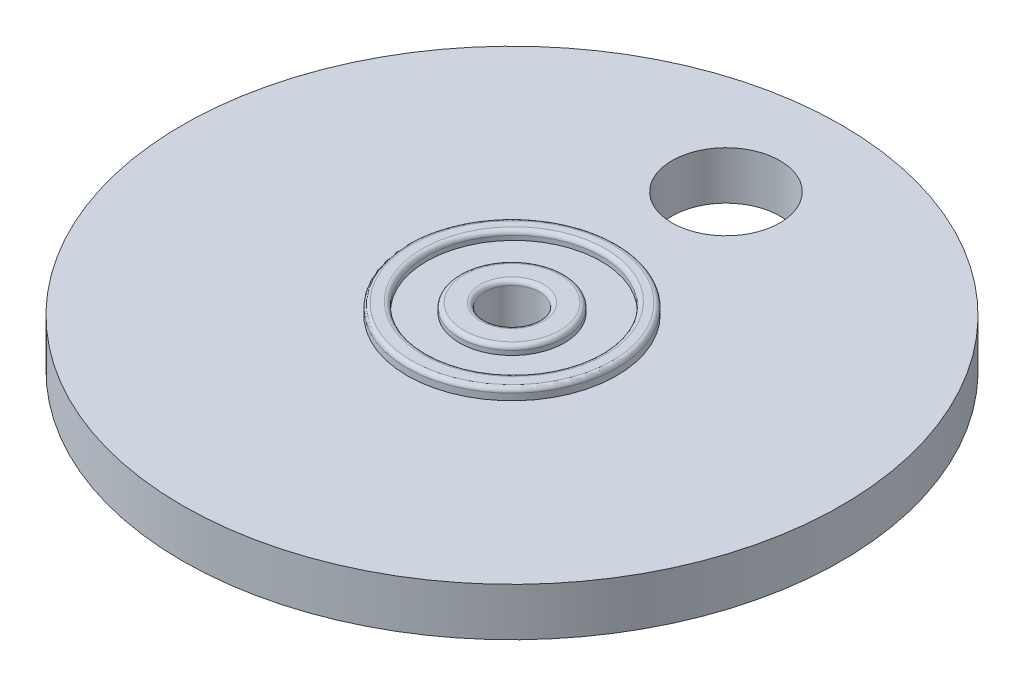
ISO-10303-21;
HEADER;
FILE_DESCRIPTION(('STEP AP214'),'2;1');
FILE_NAME('part.step','',(''),(''),'','','');
FILE_SCHEMA(('AUTOMOTIVE_DESIGN { 1 0 10303 214 1 1 1 1 }'));
ENDSEC;
DATA;
#1=APPLICATION_CONTEXT('core data for automotive mechanical design processes');
#2=APPLICATION_PROTOCOL_DEFINITION('international standard','automotive_design',2000,#1);
#3=PRODUCT_CONTEXT('',#1,'mechanical');
#4=PRODUCT('Part','Part','',(#3));
#5=PRODUCT_RELATED_PRODUCT_CATEGORY('part','',(#4));
#6=PRODUCT_DEFINITION_FORMATION('','',#4);
#7=PRODUCT_DEFINITION_CONTEXT('part definition',#1,'design');
#8=PRODUCT_DEFINITION('design','',#6,#7);
#9=PRODUCT_DEFINITION_SHAPE('','',#8);
#10=(LENGTH_UNIT() NAMED_UNIT(*) SI_UNIT(.MILLI.,.METRE.));
#11=(NAMED_UNIT(*) PLANE_ANGLE_UNIT() SI_UNIT($,.RADIAN.));
#12=(NAMED_UNIT(*) SI_UNIT($,.STERADIAN.) SOLID_ANGLE_UNIT());
#13=UNCERTAINTY_MEASURE_WITH_UNIT(LENGTH_MEASURE(1.E-05),#10,'distance_accuracy_value','');
#14=(GEOMETRIC_REPRESENTATION_CONTEXT(3) GLOBAL_UNCERTAINTY_ASSIGNED_CONTEXT((#13)) GLOBAL_UNIT_ASSIGNED_CONTEXT((#10,
#11,#12)) REPRESENTATION_CONTEXT('',''));
#15=CARTESIAN_POINT('',(0.,0.,0.));
#16=DIRECTION('',(0.,0.,1.));
#17=DIRECTION('',(1.,0.,0.));
#18=AXIS2_PLACEMENT_3D('',#15,#16,#17);
#19=CARTESIAN_POINT('',(0.,8.,0.));
#20=DIRECTION('',(0.,-1.,0.));
#21=DIRECTION('',(0.,0.,-1.));
#22=AXIS2_PLACEMENT_3D('',#19,#20,#21);
#23=CYLINDRICAL_SURFACE('',#22,12.);
#24=CARTESIAN_POINT('',(0.,0.5,0.));
#25=DIRECTION('',(0.,1.,0.));
#26=DIRECTION('',(0.,0.,1.));
#27=AXIS2_PLACEMENT_3D('',#24,#25,#26);
#28=CIRCLE('',#27,12.);
#29=CARTESIAN_POINT('',(0.,0.5,12.));
#30=VERTEX_POINT('',#29);
#31=EDGE_CURVE('E110',#30,#30,#28,.T.);
#32=ORIENTED_EDGE('',*,*,#31,.T.);
#33=EDGE_LOOP('',(#32));
#34=FACE_BOUND('',#33,.T.);
#35=CARTESIAN_POINT('',(0.,1.25,0.));
#36=DIRECTION('',(0.,1.,0.));
#37=DIRECTION('',(0.,0.,1.));
#38=AXIS2_PLACEMENT_3D('',#35,#36,#37);
#39=CIRCLE('',#38,12.);
#40=CARTESIAN_POINT('',(0.,1.25,12.));
#41=VERTEX_POINT('',#40);
#42=EDGE_CURVE('E10',#41,#41,#39,.T.);
#43=ORIENTED_EDGE('',*,*,#42,.F.);
#44=EDGE_LOOP('',(#43));
#45=FACE_BOUND('',#44,.T.);
#46=ADVANCED_FACE('F42',(#34,#45),#23,.T.);
#47=CARTESIAN_POINT('',(0.,0.,0.));
#48=DIRECTION('',(0.,1.,0.));
#49=DIRECTION('',(0.,0.,1.));
#50=AXIS2_PLACEMENT_3D('',#47,#48,#49);
#51=PLANE('',#50);
#52=CARTESIAN_POINT('',(0.,0.,0.));
#53=DIRECTION('',(0.,1.,0.));
#54=DIRECTION('',(0.,0.,1.));
#55=AXIS2_PLACEMENT_3D('',#52,#53,#54);
#56=CIRCLE('',#55,5.5);
#57=CARTESIAN_POINT('',(0.,0.,5.5));
#58=VERTEX_POINT('',#57);
#59=EDGE_CURVE('E90',#58,#58,#56,.F.);
#60=ORIENTED_EDGE('',*,*,#59,.T.);
#61=EDGE_LOOP('',(#60));
#62=FACE_BOUND('',#61,.T.);
#63=CARTESIAN_POINT('',(0.,0.,0.));
#64=DIRECTION('',(0.,1.,0.));
#65=DIRECTION('',(0.,0.,1.));
#66=AXIS2_PLACEMENT_3D('',#63,#64,#65);
#67=CIRCLE('',#66,3.625);
#68=CARTESIAN_POINT('',(0.,0.,3.625));
#69=VERTEX_POINT('',#68);
#70=EDGE_CURVE('E94',#69,#69,#67,.T.);
#71=ORIENTED_EDGE('',*,*,#70,.T.);
#72=EDGE_LOOP('',(#71));
#73=FACE_BOUND('',#72,.T.);
#74=ADVANCED_FACE('F170',(#62,#73),#51,.F.);
#75=CARTESIAN_POINT('',(0.,8.,0.));
#76=DIRECTION('',(0.,1.,0.));
#77=DIRECTION('',(0.,0.,1.));
#78=AXIS2_PLACEMENT_3D('',#75,#76,#77);
#79=PLANE('',#78);
#80=CARTESIAN_POINT('',(0.,8.,0.));
#81=DIRECTION('',(0.,1.,0.));
#82=DIRECTION('',(0.,0.,1.));
#83=AXIS2_PLACEMENT_3D('',#80,#81,#82);
#84=CIRCLE('',#83,3.625);
#85=CARTESIAN_POINT('',(0.,8.,3.625));
#86=VERTEX_POINT('',#85);
#87=EDGE_CURVE('E70',#86,#86,#84,.F.);
#88=ORIENTED_EDGE('',*,*,#87,.T.);
#89=EDGE_LOOP('',(#88));
#90=FACE_BOUND('',#89,.T.);
#91=CARTESIAN_POINT('',(0.,8.,0.));
#92=DIRECTION('',(0.,1.,0.));
#93=DIRECTION('',(0.,0.,1.));
#94=AXIS2_PLACEMENT_3D('',#91,#92,#93);
#95=CIRCLE('',#94,5.5);
#96=CARTESIAN_POINT('',(0.,8.,5.5));
#97=VERTEX_POINT('',#96);
#98=EDGE_CURVE('E74',#97,#97,#95,.T.);
#99=ORIENTED_EDGE('',*,*,#98,.T.);
#100=EDGE_LOOP('',(#99));
#101=FACE_BOUND('',#100,.T.);
#102=ADVANCED_FACE('F179',(#90,#101),#79,.T.);
#103=CARTESIAN_POINT('',(0.,8.,0.));
#104=DIRECTION('',(0.,1.,0.));
#105=DIRECTION('',(0.,0.,1.));
#106=AXIS2_PLACEMENT_3D('',#103,#104,#105);
#107=CIRCLE('',#106,11.5);
#108=CARTESIAN_POINT('',(0.,8.,11.5));
#109=VERTEX_POINT('',#108);
#110=EDGE_CURVE('E56',#109,#109,#107,.T.);
#111=ORIENTED_EDGE('',*,*,#110,.T.);
#112=EDGE_LOOP('',(#111));
#113=FACE_BOUND('',#112,.T.);
#114=CARTESIAN_POINT('',(0.,8.,-0.21755259863575));
#115=DIRECTION('',(0.,1.,0.));
#116=DIRECTION('',(0.,0.,1.));
#117=AXIS2_PLACEMENT_3D('',#114,#115,#116);
#118=CIRCLE('',#117,10.5);
#119=CARTESIAN_POINT('',(0.,8.,10.2824474013643));
#120=VERTEX_POINT('',#119);
#121=EDGE_CURVE('E62',#120,#120,#118,.F.);
#122=ORIENTED_EDGE('',*,*,#121,.T.);
#123=EDGE_LOOP('',(#122));
#124=FACE_BOUND('',#123,.T.);
#125=ADVANCED_FACE('F194',(#113,#124),#79,.T.);
#126=CARTESIAN_POINT('',(0.,0.,0.));
#127=DIRECTION('',(0.,1.,0.));
#128=DIRECTION('',(0.,0.,1.));
#129=AXIS2_PLACEMENT_3D('',#126,#127,#128);
#130=CIRCLE('',#129,11.5);
#131=CARTESIAN_POINT('',(0.,0.,11.5));
#132=VERTEX_POINT('',#131);
#133=EDGE_CURVE('E102',#132,#132,#130,.F.);
#134=ORIENTED_EDGE('',*,*,#133,.T.);
#135=EDGE_LOOP('',(#134));
#136=FACE_BOUND('',#135,.T.);
#137=CARTESIAN_POINT('',(0.,0.,-0.21755259863575));
#138=DIRECTION('',(0.,1.,0.));
#139=DIRECTION('',(0.,0.,1.));
#140=AXIS2_PLACEMENT_3D('',#137,#138,#139);
#141=CIRCLE('',#140,10.5);
#142=CARTESIAN_POINT('',(0.,0.,10.2824474013643));
#143=VERTEX_POINT('',#142);
#144=EDGE_CURVE('E106',#143,#143,#141,.T.);
#145=ORIENTED_EDGE('',*,*,#144,.T.);
#146=EDGE_LOOP('',(#145));
#147=FACE_BOUND('',#146,.T.);
#148=ADVANCED_FACE('F182',(#136,#147),#51,.F.);
#149=CARTESIAN_POINT('',(0.,6.75,0.));
#150=DIRECTION('',(0.,1.,0.));
#151=DIRECTION('',(0.,0.,1.));
#152=AXIS2_PLACEMENT_3D('',#149,#150,#151);
#153=CIRCLE('',#152,12.);
#154=CARTESIAN_POINT('',(0.,6.75,12.));
#155=VERTEX_POINT('',#154);
#156=EDGE_CURVE('E139',#155,#155,#153,.T.);
#157=ORIENTED_EDGE('',*,*,#156,.T.);
#158=EDGE_LOOP('',(#157));
#159=FACE_BOUND('',#158,.T.);
#160=CARTESIAN_POINT('',(0.,7.5,0.));
#161=DIRECTION('',(0.,1.,0.));
#162=DIRECTION('',(0.,0.,1.));
#163=AXIS2_PLACEMENT_3D('',#160,#161,#162);
#164=CIRCLE('',#163,12.);
#165=CARTESIAN_POINT('',(0.,7.5,12.));
#166=VERTEX_POINT('',#165);
#167=EDGE_CURVE('E114',#166,#166,#164,.F.);
#168=ORIENTED_EDGE('',*,*,#167,.T.);
#169=EDGE_LOOP('',(#168));
#170=FACE_BOUND('',#169,.T.);
#171=ADVANCED_FACE('F173',(#159,#170),#23,.T.);
#172=CARTESIAN_POINT('',(0.,8.,0.));
#173=DIRECTION('',(0.,-1.,0.));
#174=DIRECTION('',(0.,0.,-1.));
#175=AXIS2_PLACEMENT_3D('',#172,#173,#174);
#176=CYLINDRICAL_SURFACE('',#175,3.125);
#177=CARTESIAN_POINT('',(0.,0.5,0.));
#178=DIRECTION('',(0.,1.,0.));
#179=DIRECTION('',(0.,0.,1.));
#180=AXIS2_PLACEMENT_3D('',#177,#178,#179);
#181=CIRCLE('',#180,3.125);
#182=CARTESIAN_POINT('',(0.,0.5,3.125));
#183=VERTEX_POINT('',#182);
#184=EDGE_CURVE('E78',#183,#183,#181,.F.);
#185=ORIENTED_EDGE('',*,*,#184,.T.);
#186=EDGE_LOOP('',(#185));
#187=FACE_BOUND('',#186,.T.);
#188=CARTESIAN_POINT('',(0.,7.5,0.));
#189=DIRECTION('',(0.,1.,0.));
#190=DIRECTION('',(0.,0.,1.));
#191=AXIS2_PLACEMENT_3D('',#188,#189,#190);
#192=CIRCLE('',#191,3.125);
#193=CARTESIAN_POINT('',(0.,7.5,3.125));
#194=VERTEX_POINT('',#193);
#195=EDGE_CURVE('E82',#194,#194,#192,.T.);
#196=ORIENTED_EDGE('',*,*,#195,.T.);
#197=EDGE_LOOP('',(#196));
#198=FACE_BOUND('',#197,.T.);
#199=ADVANCED_FACE('F185',(#187,#198),#176,.F.);
#200=CARTESIAN_POINT('',(0.,7.,-0.21755259863575));
#201=DIRECTION('',(0.,1.,0.));
#202=DIRECTION('',(0.,0.,1.));
#203=AXIS2_PLACEMENT_3D('',#200,#201,#202);
#204=CYLINDRICAL_SURFACE('',#203,10.);
#205=CARTESIAN_POINT('',(0.,7.5,-0.21755259863575));
#206=DIRECTION('',(0.,1.,0.));
#207=DIRECTION('',(0.,0.,1.));
#208=AXIS2_PLACEMENT_3D('',#205,#206,#207);
#209=CIRCLE('',#208,10.);
#210=CARTESIAN_POINT('',(0.,7.5,9.78244740136425));
#211=VERTEX_POINT('',#210);
#212=EDGE_CURVE('E51',#211,#211,#209,.T.);
#213=ORIENTED_EDGE('',*,*,#212,.T.);
#214=EDGE_LOOP('',(#213));
#215=FACE_BOUND('',#214,.T.);
#216=CARTESIAN_POINT('',(0.,7.,-0.21755259863575));
#217=DIRECTION('',(0.,1.,0.));
#218=DIRECTION('',(0.,0.,1.));
#219=AXIS2_PLACEMENT_3D('',#216,#217,#218);
#220=CIRCLE('',#219,10.);
#221=CARTESIAN_POINT('',(0.,7.,9.78244740136425));
#222=VERTEX_POINT('',#221);
#223=EDGE_CURVE('E118',#222,#222,#220,.T.);
#224=ORIENTED_EDGE('',*,*,#223,.F.);
#225=EDGE_LOOP('',(#224));
#226=FACE_BOUND('',#225,.T.);
#227=ADVANCED_FACE('F190',(#215,#226),#204,.F.);
#228=CARTESIAN_POINT('',(0.,7.,-0.21755259863575));
#229=DIRECTION('',(0.,1.,0.));
#230=DIRECTION('',(0.,0.,1.));
#231=AXIS2_PLACEMENT_3D('',#228,#229,#230);
#232=PLANE('',#231);
#233=CARTESIAN_POINT('',(0.,7.,0.));
#234=DIRECTION('',(0.,1.,0.));
#235=DIRECTION('',(0.,0.,1.));
#236=AXIS2_PLACEMENT_3D('',#233,#234,#235);
#237=CIRCLE('',#236,6.);
#238=CARTESIAN_POINT('',(0.,7.,6.));
#239=VERTEX_POINT('',#238);
#240=EDGE_CURVE('E122',#239,#239,#237,.T.);
#241=ORIENTED_EDGE('',*,*,#240,.F.);
#242=EDGE_LOOP('',(#241));
#243=FACE_BOUND('',#242,.T.);
#244=ORIENTED_EDGE('',*,*,#223,.T.);
#245=EDGE_LOOP('',(#244));
#246=FACE_BOUND('',#245,.T.);
#247=ADVANCED_FACE('F217',(#243,#246),#232,.T.);
#248=CARTESIAN_POINT('',(0.,7.,0.));
#249=DIRECTION('',(0.,1.,0.));
#250=DIRECTION('',(0.,0.,1.));
#251=AXIS2_PLACEMENT_3D('',#248,#249,#250);
#252=CYLINDRICAL_SURFACE('',#251,6.);
#253=CARTESIAN_POINT('',(0.,7.5,0.));
#254=DIRECTION('',(0.,1.,0.));
#255=DIRECTION('',(0.,0.,1.));
#256=AXIS2_PLACEMENT_3D('',#253,#254,#255);
#257=CIRCLE('',#256,6.);
#258=CARTESIAN_POINT('',(0.,7.5,6.));
#259=VERTEX_POINT('',#258);
#260=EDGE_CURVE('E66',#259,#259,#257,.F.);
#261=ORIENTED_EDGE('',*,*,#260,.T.);
#262=EDGE_LOOP('',(#261));
#263=FACE_BOUND('',#262,.T.);
#264=ORIENTED_EDGE('',*,*,#240,.T.);
#265=EDGE_LOOP('',(#264));
#266=FACE_BOUND('',#265,.T.);
#267=ADVANCED_FACE('F222',(#263,#266),#252,.T.);
#268=CARTESIAN_POINT('',(0.,1.,-0.21755259863575));
#269=DIRECTION('',(0.,-1.,0.));
#270=DIRECTION('',(0.,0.,-1.));
#271=AXIS2_PLACEMENT_3D('',#268,#269,#270);
#272=CYLINDRICAL_SURFACE('',#271,10.);
#273=CARTESIAN_POINT('',(0.,0.5,-0.21755259863575));
#274=DIRECTION('',(0.,1.,0.));
#275=DIRECTION('',(0.,0.,1.));
#276=AXIS2_PLACEMENT_3D('',#273,#274,#275);
#277=CIRCLE('',#276,10.);
#278=CARTESIAN_POINT('',(0.,0.5,9.78244740136425));
#279=VERTEX_POINT('',#278);
#280=EDGE_CURVE('E98',#279,#279,#277,.F.);
#281=ORIENTED_EDGE('',*,*,#280,.T.);
#282=EDGE_LOOP('',(#281));
#283=FACE_BOUND('',#282,.T.);
#284=CARTESIAN_POINT('',(0.,1.,-0.21755259863575));
#285=DIRECTION('',(0.,-1.,0.));
#286=DIRECTION('',(0.,0.,-1.));
#287=AXIS2_PLACEMENT_3D('',#284,#285,#286);
#288=CIRCLE('',#287,10.);
#289=CARTESIAN_POINT('',(0.,1.,-10.2175525986358));
#290=VERTEX_POINT('',#289);
#291=EDGE_CURVE('E126',#290,#290,#288,.T.);
#292=ORIENTED_EDGE('',*,*,#291,.F.);
#293=EDGE_LOOP('',(#292));
#294=FACE_BOUND('',#293,.T.);
#295=ADVANCED_FACE('F229',(#283,#294),#272,.F.);
#296=CARTESIAN_POINT('',(0.,1.,-0.21755259863575));
#297=DIRECTION('',(0.,-1.,0.));
#298=DIRECTION('',(0.,0.,-1.));
#299=AXIS2_PLACEMENT_3D('',#296,#297,#298);
#300=PLANE('',#299);
#301=CARTESIAN_POINT('',(0.,1.,0.));
#302=DIRECTION('',(0.,-1.,0.));
#303=DIRECTION('',(0.,0.,-1.));
#304=AXIS2_PLACEMENT_3D('',#301,#302,#303);
#305=CIRCLE('',#304,6.);
#306=CARTESIAN_POINT('',(0.,1.,-6.));
#307=VERTEX_POINT('',#306);
#308=EDGE_CURVE('E130',#307,#307,#305,.T.);
#309=ORIENTED_EDGE('',*,*,#308,.F.);
#310=EDGE_LOOP('',(#309));
#311=FACE_BOUND('',#310,.T.);
#312=ORIENTED_EDGE('',*,*,#291,.T.);
#313=EDGE_LOOP('',(#312));
#314=FACE_BOUND('',#313,.T.);
#315=ADVANCED_FACE('F236',(#311,#314),#300,.T.);
#316=CARTESIAN_POINT('',(0.,1.,0.));
#317=DIRECTION('',(0.,-1.,0.));
#318=DIRECTION('',(0.,0.,-1.));
#319=AXIS2_PLACEMENT_3D('',#316,#317,#318);
#320=CYLINDRICAL_SURFACE('',#319,6.);
#321=CARTESIAN_POINT('',(0.,0.5,0.));
#322=DIRECTION('',(0.,1.,0.));
#323=DIRECTION('',(0.,0.,1.));
#324=AXIS2_PLACEMENT_3D('',#321,#322,#323);
#325=CIRCLE('',#324,6.);
#326=CARTESIAN_POINT('',(0.,0.5,6.));
#327=VERTEX_POINT('',#326);
#328=EDGE_CURVE('E86',#327,#327,#325,.T.);
#329=ORIENTED_EDGE('',*,*,#328,.T.);
#330=EDGE_LOOP('',(#329));
#331=FACE_BOUND('',#330,.T.);
#332=ORIENTED_EDGE('',*,*,#308,.T.);
#333=EDGE_LOOP('',(#332));
#334=FACE_BOUND('',#333,.T.);
#335=ADVANCED_FACE('F239',(#331,#334),#320,.T.);
#336=CARTESIAN_POINT('',(0.,0.5,0.));
#337=DIRECTION('',(0.,1.,0.));
#338=DIRECTION('',(0.,0.,1.));
#339=AXIS2_PLACEMENT_3D('',#336,#337,#338);
#340=TOROIDAL_SURFACE('',#339,11.5,0.5);
#341=ORIENTED_EDGE('',*,*,#133,.F.);
#342=EDGE_LOOP('',(#341));
#343=FACE_BOUND('',#342,.T.);
#344=ORIENTED_EDGE('',*,*,#31,.F.);
#345=EDGE_LOOP('',(#344));
#346=FACE_BOUND('',#345,.T.);
#347=ADVANCED_FACE('F242',(#343,#346),#340,.T.);
#348=CARTESIAN_POINT('',(0.,0.5,-0.21755259863575));
#349=DIRECTION('',(0.,1.,0.));
#350=DIRECTION('',(0.,0.,1.));
#351=AXIS2_PLACEMENT_3D('',#348,#349,#350);
#352=TOROIDAL_SURFACE('',#351,10.5,0.5);
#353=ORIENTED_EDGE('',*,*,#144,.F.);
#354=EDGE_LOOP('',(#353));
#355=FACE_BOUND('',#354,.T.);
#356=ORIENTED_EDGE('',*,*,#280,.F.);
#357=EDGE_LOOP('',(#356));
#358=FACE_BOUND('',#357,.T.);
#359=ADVANCED_FACE('F320',(#355,#358),#352,.T.);
#360=CARTESIAN_POINT('',(0.,0.5,0.));
#361=DIRECTION('',(0.,1.,0.));
#362=DIRECTION('',(0.,0.,1.));
#363=AXIS2_PLACEMENT_3D('',#360,#361,#362);
#364=TOROIDAL_SURFACE('',#363,5.5,0.5);
#365=ORIENTED_EDGE('',*,*,#328,.F.);
#366=EDGE_LOOP('',(#365));
#367=FACE_BOUND('',#366,.T.);
#368=ORIENTED_EDGE('',*,*,#59,.F.);
#369=EDGE_LOOP('',(#368));
#370=FACE_BOUND('',#369,.T.);
#371=ADVANCED_FACE('F311',(#367,#370),#364,.T.);
#372=CARTESIAN_POINT('',(0.,0.5,0.));
#373=DIRECTION('',(0.,1.,0.));
#374=DIRECTION('',(0.,0.,1.));
#375=AXIS2_PLACEMENT_3D('',#372,#373,#374);
#376=TOROIDAL_SURFACE('',#375,3.625,0.5);
#377=ORIENTED_EDGE('',*,*,#184,.F.);
#378=EDGE_LOOP('',(#377));
#379=FACE_BOUND('',#378,.T.);
#380=ORIENTED_EDGE('',*,*,#70,.F.);
#381=EDGE_LOOP('',(#380));
#382=FACE_BOUND('',#381,.T.);
#383=ADVANCED_FACE('F302',(#379,#382),#376,.T.);
#384=CARTESIAN_POINT('',(0.,7.5,0.));
#385=DIRECTION('',(0.,1.,0.));
#386=DIRECTION('',(0.,0.,1.));
#387=AXIS2_PLACEMENT_3D('',#384,#385,#386);
#388=TOROIDAL_SURFACE('',#387,3.625,0.5);
#389=ORIENTED_EDGE('',*,*,#87,.F.);
#390=EDGE_LOOP('',(#389));
#391=FACE_BOUND('',#390,.T.);
#392=ORIENTED_EDGE('',*,*,#195,.F.);
#393=EDGE_LOOP('',(#392));
#394=FACE_BOUND('',#393,.T.);
#395=ADVANCED_FACE('F293',(#391,#394),#388,.T.);
#396=CARTESIAN_POINT('',(0.,7.5,0.));
#397=DIRECTION('',(0.,1.,0.));
#398=DIRECTION('',(0.,0.,1.));
#399=AXIS2_PLACEMENT_3D('',#396,#397,#398);
#400=TOROIDAL_SURFACE('',#399,5.5,0.5);
#401=ORIENTED_EDGE('',*,*,#260,.F.);
#402=EDGE_LOOP('',(#401));
#403=FACE_BOUND('',#402,.T.);
#404=ORIENTED_EDGE('',*,*,#98,.F.);
#405=EDGE_LOOP('',(#404));
#406=FACE_BOUND('',#405,.T.);
#407=ADVANCED_FACE('F203',(#403,#406),#400,.T.);
#408=CARTESIAN_POINT('',(0.,7.5,0.));
#409=DIRECTION('',(0.,1.,0.));
#410=DIRECTION('',(0.,0.,1.));
#411=AXIS2_PLACEMENT_3D('',#408,#409,#410);
#412=TOROIDAL_SURFACE('',#411,11.5,0.5);
#413=ORIENTED_EDGE('',*,*,#167,.F.);
#414=EDGE_LOOP('',(#413));
#415=FACE_BOUND('',#414,.T.);
#416=ORIENTED_EDGE('',*,*,#110,.F.);
#417=EDGE_LOOP('',(#416));
#418=FACE_BOUND('',#417,.T.);
#419=ADVANCED_FACE('F200',(#415,#418),#412,.T.);
#420=CARTESIAN_POINT('',(0.,7.5,-0.21755259863575));
#421=DIRECTION('',(0.,1.,0.));
#422=DIRECTION('',(0.,0.,1.));
#423=AXIS2_PLACEMENT_3D('',#420,#421,#422);
#424=TOROIDAL_SURFACE('',#423,10.5,0.5);
#425=ORIENTED_EDGE('',*,*,#121,.F.);
#426=EDGE_LOOP('',(#425));
#427=FACE_BOUND('',#426,.T.);
#428=ORIENTED_EDGE('',*,*,#212,.F.);
#429=EDGE_LOOP('',(#428));
#430=FACE_BOUND('',#429,.T.);
#431=ADVANCED_FACE('F44',(#427,#430),#424,.T.);
#432=CARTESIAN_POINT('',(0.,6.75,0.));
#433=DIRECTION('',(0.,1.,0.));
#434=DIRECTION('',(0.,0.,1.));
#435=AXIS2_PLACEMENT_3D('',#432,#433,#434);
#436=PLANE('',#435);
#437=CARTESIAN_POINT('',(0.,6.75,-24.5082764472327));
#438=DIRECTION('',(0.,1.,0.));
#439=DIRECTION('',(0.,0.,1.));
#440=AXIS2_PLACEMENT_3D('',#437,#438,#439);
#441=CIRCLE('',#440,6.18249990084113);
#442=CARTESIAN_POINT('',(0.,6.75,-18.3257765463916));
#443=VERTEX_POINT('',#442);
#444=EDGE_CURVE('E146',#443,#443,#441,.T.);
#445=ORIENTED_EDGE('',*,*,#444,.F.);
#446=EDGE_LOOP('',(#445));
#447=FACE_BOUND('',#446,.T.);
#448=CARTESIAN_POINT('',(0.,6.75,0.));
#449=DIRECTION('',(0.,1.,0.));
#450=DIRECTION('',(0.,0.,1.));
#451=AXIS2_PLACEMENT_3D('',#448,#449,#450);
#452=CIRCLE('',#451,37.75);
#453=CARTESIAN_POINT('',(0.,6.75,37.75));
#454=VERTEX_POINT('',#453);
#455=EDGE_CURVE('E134',#454,#454,#452,.T.);
#456=ORIENTED_EDGE('',*,*,#455,.T.);
#457=EDGE_LOOP('',(#456));
#458=FACE_BOUND('',#457,.T.);
#459=ORIENTED_EDGE('',*,*,#156,.F.);
#460=EDGE_LOOP('',(#459));
#461=FACE_BOUND('',#460,.T.);
#462=ADVANCED_FACE('F212',(#447,#458,#461),#436,.T.);
#463=CARTESIAN_POINT('',(0.,1.25,0.));
#464=DIRECTION('',(0.,1.,0.));
#465=DIRECTION('',(0.,0.,1.));
#466=AXIS2_PLACEMENT_3D('',#463,#464,#465);
#467=PLANE('',#466);
#468=CARTESIAN_POINT('',(0.,1.25,-24.5082764472327));
#469=DIRECTION('',(0.,1.,0.));
#470=DIRECTION('',(0.,0.,1.));
#471=AXIS2_PLACEMENT_3D('',#468,#469,#470);
#472=CIRCLE('',#471,6.18249990084113);
#473=CARTESIAN_POINT('',(0.,1.25,-18.3257765463916));
#474=VERTEX_POINT('',#473);
#475=EDGE_CURVE('E46',#474,#474,#472,.T.);
#476=ORIENTED_EDGE('',*,*,#475,.T.);
#477=EDGE_LOOP('',(#476));
#478=FACE_BOUND('',#477,.T.);
#479=CARTESIAN_POINT('',(0.,1.25,0.));
#480=DIRECTION('',(0.,1.,0.));
#481=DIRECTION('',(0.,0.,1.));
#482=AXIS2_PLACEMENT_3D('',#479,#480,#481);
#483=CIRCLE('',#482,37.75);
#484=CARTESIAN_POINT('',(0.,1.25,37.75));
#485=VERTEX_POINT('',#484);
#486=EDGE_CURVE('E135',#485,#485,#483,.T.);
#487=ORIENTED_EDGE('',*,*,#486,.F.);
#488=EDGE_LOOP('',(#487));
#489=FACE_BOUND('',#488,.T.);
#490=ORIENTED_EDGE('',*,*,#42,.T.);
#491=EDGE_LOOP('',(#490));
#492=FACE_BOUND('',#491,.T.);
#493=ADVANCED_FACE('F155',(#478,#489,#492),#467,.F.);
#494=CARTESIAN_POINT('',(0.,6.75,0.));
#495=DIRECTION('',(0.,-1.,0.));
#496=DIRECTION('',(0.,0.,-1.));
#497=AXIS2_PLACEMENT_3D('',#494,#495,#496);
#498=CYLINDRICAL_SURFACE('',#497,37.75);
#499=ORIENTED_EDGE('',*,*,#455,.F.);
#500=EDGE_LOOP('',(#499));
#501=FACE_BOUND('',#500,.T.);
#502=ORIENTED_EDGE('',*,*,#486,.T.);
#503=EDGE_LOOP('',(#502));
#504=FACE_BOUND('',#503,.T.);
#505=ADVANCED_FACE('F160',(#501,#504),#498,.T.);
#506=CARTESIAN_POINT('',(0.,0.,-24.5082764472327));
#507=DIRECTION('',(0.,1.,0.));
#508=DIRECTION('',(0.,0.,1.));
#509=AXIS2_PLACEMENT_3D('',#506,#507,#508);
#510=CYLINDRICAL_SURFACE('',#509,6.18249990084113);
#511=ORIENTED_EDGE('',*,*,#444,.T.);
#512=EDGE_LOOP('',(#511));
#513=FACE_BOUND('',#512,.T.);
#514=ORIENTED_EDGE('',*,*,#475,.F.);
#515=EDGE_LOOP('',(#514));
#516=FACE_BOUND('',#515,.T.);
#517=ADVANCED_FACE('F158',(#513,#516),#510,.F.);
#518=CLOSED_SHELL('',(#46,#74,#102,#125,#148,#171,#199,#227,#247,#267,#295,#315,#335,#347,#359,
#371,#383,#395,#407,#419,#431,#462,#493,#505,#517));
#519=MANIFOLD_SOLID_BREP('B2',#518);
#520=ADVANCED_BREP_SHAPE_REPRESENTATION('',(#18,#519),#14);
#521=SHAPE_DEFINITION_REPRESENTATION(#9,#520);
ENDSEC;
END-ISO-10303-21;
